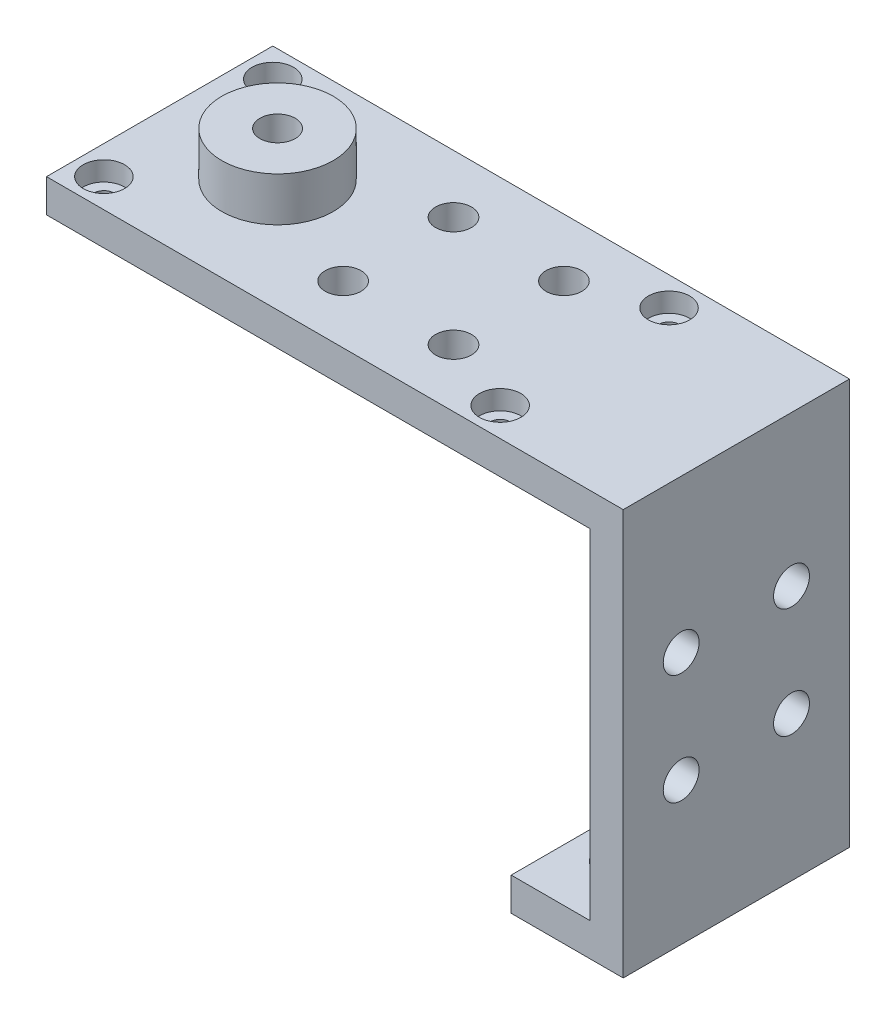
ISO-10303-21;
HEADER;
FILE_DESCRIPTION(('STEP AP214'),'2;1');
FILE_NAME('part.step','',(''),(''),'','','');
FILE_SCHEMA(('AUTOMOTIVE_DESIGN { 1 0 10303 214 1 1 1 1 }'));
ENDSEC;
DATA;
#1=APPLICATION_CONTEXT('core data for automotive mechanical design processes');
#2=APPLICATION_PROTOCOL_DEFINITION('international standard','automotive_design',2000,#1);
#3=PRODUCT_CONTEXT('',#1,'mechanical');
#4=PRODUCT('Part','Part','',(#3));
#5=PRODUCT_RELATED_PRODUCT_CATEGORY('part','',(#4));
#6=PRODUCT_DEFINITION_FORMATION('','',#4);
#7=PRODUCT_DEFINITION_CONTEXT('part definition',#1,'design');
#8=PRODUCT_DEFINITION('design','',#6,#7);
#9=PRODUCT_DEFINITION_SHAPE('','',#8);
#10=(LENGTH_UNIT() NAMED_UNIT(*) SI_UNIT(.MILLI.,.METRE.));
#11=(NAMED_UNIT(*) PLANE_ANGLE_UNIT() SI_UNIT($,.RADIAN.));
#12=(NAMED_UNIT(*) SI_UNIT($,.STERADIAN.) SOLID_ANGLE_UNIT());
#13=UNCERTAINTY_MEASURE_WITH_UNIT(LENGTH_MEASURE(1.E-05),#10,'distance_accuracy_value','');
#14=(GEOMETRIC_REPRESENTATION_CONTEXT(3) GLOBAL_UNCERTAINTY_ASSIGNED_CONTEXT((#13)) GLOBAL_UNIT_ASSIGNED_CONTEXT((#10,
#11,#12)) REPRESENTATION_CONTEXT('',''));
#15=CARTESIAN_POINT('',(0.,0.,0.));
#16=DIRECTION('',(0.,0.,1.));
#17=DIRECTION('',(1.,0.,0.));
#18=AXIS2_PLACEMENT_3D('',#15,#16,#17);
#19=CARTESIAN_POINT('',(15.975,-33.75,-10.25));
#20=DIRECTION('',(0.,-1.,0.));
#21=DIRECTION('',(0.,0.,-1.));
#22=AXIS2_PLACEMENT_3D('',#19,#20,#21);
#23=PLANE('',#22);
#24=CARTESIAN_POINT('',(19.575,-33.75,-4.475));
#25=DIRECTION('',(0.,-1.,0.));
#26=DIRECTION('',(0.,0.,-1.));
#27=AXIS2_PLACEMENT_3D('',#24,#25,#26);
#28=CIRCLE('',#27,1.625);
#29=CARTESIAN_POINT('',(19.575,-33.75,-6.1));
#30=VERTEX_POINT('',#29);
#31=EDGE_CURVE('E259',#30,#30,#28,.F.);
#32=ORIENTED_EDGE('',*,*,#31,.F.);
#33=EDGE_LOOP('',(#32));
#34=FACE_BOUND('',#33,.T.);
#35=DIRECTION('',(0.,0.,-1.));
#36=VECTOR('',#35,1.);
#37=CARTESIAN_POINT('',(15.975,-33.75,-10.25));
#38=LINE('',#37,#36);
#39=CARTESIAN_POINT('',(15.975,-33.75,-0.664672500903811));
#40=VERTEX_POINT('',#39);
#41=CARTESIAN_POINT('',(15.975,-33.75,-10.25));
#42=VERTEX_POINT('',#41);
#43=EDGE_CURVE('E148',#40,#42,#38,.T.);
#44=ORIENTED_EDGE('',*,*,#43,.F.);
#45=DIRECTION('',(-1.,0.,0.));
#46=VECTOR('',#45,1.);
#47=CARTESIAN_POINT('',(25.3453603311175,-33.75,-0.664672500903811));
#48=LINE('',#47,#46);
#49=CARTESIAN_POINT('',(23.125,-33.75,-0.664672500903811));
#50=VERTEX_POINT('',#49);
#51=EDGE_CURVE('E136',#50,#40,#48,.T.);
#52=ORIENTED_EDGE('',*,*,#51,.F.);
#53=DIRECTION('',(0.,0.,-1.));
#54=VECTOR('',#53,1.);
#55=CARTESIAN_POINT('',(23.125,-33.75,-10.25));
#56=LINE('',#55,#54);
#57=CARTESIAN_POINT('',(23.125,-33.75,-10.25));
#58=VERTEX_POINT('',#57);
#59=EDGE_CURVE('E146',#50,#58,#56,.T.);
#60=ORIENTED_EDGE('',*,*,#59,.T.);
#61=DIRECTION('',(1.,0.,0.));
#62=VECTOR('',#61,1.);
#63=CARTESIAN_POINT('',(15.975,-33.75,-10.25));
#64=LINE('',#63,#62);
#65=EDGE_CURVE('E169',#42,#58,#64,.T.);
#66=ORIENTED_EDGE('',*,*,#65,.F.);
#67=EDGE_LOOP('',(#44,#52,#60,#66));
#68=FACE_BOUND('',#67,.T.);
#69=ADVANCED_FACE('F39',(#34,#68),#23,.F.);
#70=CARTESIAN_POINT('',(23.125,-36.75,10.25));
#71=DIRECTION('',(1.,0.,0.));
#72=DIRECTION('',(0.,0.,-1.));
#73=AXIS2_PLACEMENT_3D('',#70,#71,#72);
#74=PLANE('',#73);
#75=CARTESIAN_POINT('',(23.125,-13.8360700129091,5.));
#76=DIRECTION('',(-1.,0.,0.));
#77=DIRECTION('',(0.,0.,1.));
#78=AXIS2_PLACEMENT_3D('',#75,#76,#77);
#79=CIRCLE('',#78,1.625);
#80=CARTESIAN_POINT('',(23.125,-13.8360700129091,6.625));
#81=VERTEX_POINT('',#80);
#82=EDGE_CURVE('E552',#81,#81,#79,.T.);
#83=ORIENTED_EDGE('',*,*,#82,.F.);
#84=EDGE_LOOP('',(#83));
#85=FACE_BOUND('',#84,.T.);
#86=CARTESIAN_POINT('',(23.125,-23.8360700129091,5.));
#87=DIRECTION('',(-1.,0.,0.));
#88=DIRECTION('',(0.,0.,1.));
#89=AXIS2_PLACEMENT_3D('',#86,#87,#88);
#90=CIRCLE('',#89,1.625);
#91=CARTESIAN_POINT('',(23.125,-23.8360700129091,6.625));
#92=VERTEX_POINT('',#91);
#93=EDGE_CURVE('E563',#92,#92,#90,.T.);
#94=ORIENTED_EDGE('',*,*,#93,.F.);
#95=EDGE_LOOP('',(#94));
#96=FACE_BOUND('',#95,.T.);
#97=CARTESIAN_POINT('',(23.125,-23.625,-4.99777222433331));
#98=DIRECTION('',(-1.,0.,0.));
#99=DIRECTION('',(0.,0.,1.));
#100=AXIS2_PLACEMENT_3D('',#97,#98,#99);
#101=CIRCLE('',#100,1.625);
#102=CARTESIAN_POINT('',(23.125,-23.625,-3.37277222433331));
#103=VERTEX_POINT('',#102);
#104=EDGE_CURVE('E553',#103,#103,#101,.T.);
#105=ORIENTED_EDGE('',*,*,#104,.F.);
#106=EDGE_LOOP('',(#105));
#107=FACE_BOUND('',#106,.T.);
#108=CARTESIAN_POINT('',(23.125,-13.625,-4.99777222433331));
#109=DIRECTION('',(-1.,0.,0.));
#110=DIRECTION('',(0.,0.,1.));
#111=AXIS2_PLACEMENT_3D('',#108,#109,#110);
#112=CIRCLE('',#111,1.625);
#113=CARTESIAN_POINT('',(23.125,-13.625,-3.37277222433331));
#114=VERTEX_POINT('',#113);
#115=EDGE_CURVE('E562',#114,#114,#112,.T.);
#116=ORIENTED_EDGE('',*,*,#115,.F.);
#117=EDGE_LOOP('',(#116));
#118=FACE_BOUND('',#117,.T.);
#119=CARTESIAN_POINT('',(23.125,-33.75,10.25));
#120=VERTEX_POINT('',#119);
#121=CARTESIAN_POINT('',(23.125,-33.75,1.13532749909619));
#122=VERTEX_POINT('',#121);
#123=EDGE_CURVE('E155',#120,#122,#56,.T.);
#124=ORIENTED_EDGE('',*,*,#123,.F.);
#125=DIRECTION('',(0.,1.,0.));
#126=VECTOR('',#125,1.);
#127=CARTESIAN_POINT('',(23.125,-36.75,10.25));
#128=LINE('',#127,#126);
#129=CARTESIAN_POINT('',(23.125,-3.,10.25));
#130=VERTEX_POINT('',#129);
#131=EDGE_CURVE('E63',#120,#130,#128,.T.);
#132=ORIENTED_EDGE('',*,*,#131,.T.);
#133=DIRECTION('',(0.,0.,-1.));
#134=VECTOR('',#133,1.);
#135=CARTESIAN_POINT('',(23.125,-3.,10.25));
#136=LINE('',#135,#134);
#137=CARTESIAN_POINT('',(23.125,-3.,-10.25));
#138=VERTEX_POINT('',#137);
#139=EDGE_CURVE('E175',#130,#138,#136,.T.);
#140=ORIENTED_EDGE('',*,*,#139,.T.);
#141=DIRECTION('',(0.,1.,0.));
#142=VECTOR('',#141,1.);
#143=CARTESIAN_POINT('',(23.125,-36.75,-10.25));
#144=LINE('',#143,#142);
#145=EDGE_CURVE('E153',#58,#138,#144,.T.);
#146=ORIENTED_EDGE('',*,*,#145,.F.);
#147=ORIENTED_EDGE('',*,*,#59,.F.);
#148=DIRECTION('',(0.,-1.,0.));
#149=VECTOR('',#148,1.);
#150=CARTESIAN_POINT('',(23.125,-35.05,-0.664672500903811));
#151=LINE('',#150,#149);
#152=CARTESIAN_POINT('',(23.125,-35.05,-0.664672500903811));
#153=VERTEX_POINT('',#152);
#154=EDGE_CURVE('E132',#50,#153,#151,.T.);
#155=ORIENTED_EDGE('',*,*,#154,.T.);
#156=DIRECTION('',(0.,0.,1.));
#157=VECTOR('',#156,1.);
#158=CARTESIAN_POINT('',(23.125,-35.05,-0.664672500903811));
#159=LINE('',#158,#157);
#160=CARTESIAN_POINT('',(23.125,-35.05,1.13532749909619));
#161=VERTEX_POINT('',#160);
#162=EDGE_CURVE('E591',#153,#161,#159,.T.);
#163=ORIENTED_EDGE('',*,*,#162,.T.);
#164=DIRECTION('',(0.,1.,0.));
#165=VECTOR('',#164,1.);
#166=CARTESIAN_POINT('',(23.125,-35.05,1.13532749909619));
#167=LINE('',#166,#165);
#168=EDGE_CURVE('E277',#161,#122,#167,.T.);
#169=ORIENTED_EDGE('',*,*,#168,.T.);
#170=EDGE_LOOP('',(#124,#132,#140,#146,#147,#155,#163,#169));
#171=FACE_BOUND('',#170,.T.);
#172=ADVANCED_FACE('F152',(#85,#96,#107,#118,#171),#74,.F.);
#173=CARTESIAN_POINT('',(26.125,-3.,10.25));
#174=DIRECTION('',(1.,0.,0.));
#175=DIRECTION('',(0.,0.,-1.));
#176=AXIS2_PLACEMENT_3D('',#173,#174,#175);
#177=PLANE('',#176);
#178=CARTESIAN_POINT('',(26.125,-13.8360700129091,5.));
#179=DIRECTION('',(1.,0.,0.));
#180=DIRECTION('',(0.,0.,-1.));
#181=AXIS2_PLACEMENT_3D('',#178,#179,#180);
#182=CIRCLE('',#181,1.625);
#183=CARTESIAN_POINT('',(26.125,-13.8360700129091,3.375));
#184=VERTEX_POINT('',#183);
#185=EDGE_CURVE('E567',#184,#184,#182,.F.);
#186=ORIENTED_EDGE('',*,*,#185,.T.);
#187=EDGE_LOOP('',(#186));
#188=FACE_BOUND('',#187,.T.);
#189=CARTESIAN_POINT('',(26.125,-23.8360700129091,5.));
#190=DIRECTION('',(1.,0.,0.));
#191=DIRECTION('',(0.,0.,-1.));
#192=AXIS2_PLACEMENT_3D('',#189,#190,#191);
#193=CIRCLE('',#192,1.625);
#194=CARTESIAN_POINT('',(26.125,-23.8360700129091,3.375));
#195=VERTEX_POINT('',#194);
#196=EDGE_CURVE('E558',#195,#195,#193,.F.);
#197=ORIENTED_EDGE('',*,*,#196,.T.);
#198=EDGE_LOOP('',(#197));
#199=FACE_BOUND('',#198,.T.);
#200=CARTESIAN_POINT('',(26.125,-23.625,-4.99777222433331));
#201=DIRECTION('',(1.,0.,0.));
#202=DIRECTION('',(0.,0.,-1.));
#203=AXIS2_PLACEMENT_3D('',#200,#201,#202);
#204=CIRCLE('',#203,1.625);
#205=CARTESIAN_POINT('',(26.125,-23.625,-6.62277222433331));
#206=VERTEX_POINT('',#205);
#207=EDGE_CURVE('E557',#206,#206,#204,.F.);
#208=ORIENTED_EDGE('',*,*,#207,.T.);
#209=EDGE_LOOP('',(#208));
#210=FACE_BOUND('',#209,.T.);
#211=CARTESIAN_POINT('',(26.125,-13.625,-4.99777222433331));
#212=DIRECTION('',(1.,0.,0.));
#213=DIRECTION('',(0.,0.,-1.));
#214=AXIS2_PLACEMENT_3D('',#211,#212,#213);
#215=CIRCLE('',#214,1.625);
#216=CARTESIAN_POINT('',(26.125,-13.625,-6.62277222433331));
#217=VERTEX_POINT('',#216);
#218=EDGE_CURVE('E580',#217,#217,#215,.F.);
#219=ORIENTED_EDGE('',*,*,#218,.T.);
#220=EDGE_LOOP('',(#219));
#221=FACE_BOUND('',#220,.T.);
#222=DIRECTION('',(0.,0.,-1.));
#223=VECTOR('',#222,1.);
#224=CARTESIAN_POINT('',(26.125,0.,10.25));
#225=LINE('',#224,#223);
#226=CARTESIAN_POINT('',(26.125,0.,10.25));
#227=VERTEX_POINT('',#226);
#228=CARTESIAN_POINT('',(26.125,0.,-10.25));
#229=VERTEX_POINT('',#228);
#230=EDGE_CURVE('E193',#227,#229,#225,.T.);
#231=ORIENTED_EDGE('',*,*,#230,.F.);
#232=DIRECTION('',(0.,1.,0.));
#233=VECTOR('',#232,1.);
#234=CARTESIAN_POINT('',(26.125,-3.,10.25));
#235=LINE('',#234,#233);
#236=CARTESIAN_POINT('',(26.125,-36.75,10.25));
#237=VERTEX_POINT('',#236);
#238=EDGE_CURVE('E48',#237,#227,#235,.T.);
#239=ORIENTED_EDGE('',*,*,#238,.F.);
#240=DIRECTION('',(0.,0.,1.));
#241=VECTOR('',#240,1.);
#242=CARTESIAN_POINT('',(26.125,-36.75,10.25));
#243=LINE('',#242,#241);
#244=CARTESIAN_POINT('',(26.125,-36.75,-10.25));
#245=VERTEX_POINT('',#244);
#246=EDGE_CURVE('E176',#245,#237,#243,.T.);
#247=ORIENTED_EDGE('',*,*,#246,.F.);
#248=DIRECTION('',(0.,1.,0.));
#249=VECTOR('',#248,1.);
#250=CARTESIAN_POINT('',(26.125,-3.,-10.25));
#251=LINE('',#250,#249);
#252=EDGE_CURVE('E206',#245,#229,#251,.T.);
#253=ORIENTED_EDGE('',*,*,#252,.T.);
#254=EDGE_LOOP('',(#231,#239,#247,#253));
#255=FACE_BOUND('',#254,.T.);
#256=ADVANCED_FACE('F41',(#188,#199,#210,#221,#255),#177,.T.);
#257=CARTESIAN_POINT('',(-26.125,-3.,10.25));
#258=DIRECTION('',(0.,0.,1.));
#259=DIRECTION('',(1.,0.,0.));
#260=AXIS2_PLACEMENT_3D('',#257,#258,#259);
#261=PLANE('',#260);
#262=DIRECTION('',(1.,0.,0.));
#263=VECTOR('',#262,1.);
#264=CARTESIAN_POINT('',(-26.125,0.,10.25));
#265=LINE('',#264,#263);
#266=CARTESIAN_POINT('',(-26.125,0.,10.25));
#267=VERTEX_POINT('',#266);
#268=EDGE_CURVE('E198',#267,#227,#265,.T.);
#269=ORIENTED_EDGE('',*,*,#268,.F.);
#270=DIRECTION('',(0.,1.,0.));
#271=VECTOR('',#270,1.);
#272=CARTESIAN_POINT('',(-26.125,-3.,10.25));
#273=LINE('',#272,#271);
#274=CARTESIAN_POINT('',(-26.125,-3.,10.25));
#275=VERTEX_POINT('',#274);
#276=EDGE_CURVE('E223',#275,#267,#273,.T.);
#277=ORIENTED_EDGE('',*,*,#276,.F.);
#278=DIRECTION('',(1.,0.,0.));
#279=VECTOR('',#278,1.);
#280=CARTESIAN_POINT('',(-26.125,-3.,10.25));
#281=LINE('',#280,#279);
#282=EDGE_CURVE('E202',#275,#130,#281,.T.);
#283=ORIENTED_EDGE('',*,*,#282,.T.);
#284=ORIENTED_EDGE('',*,*,#131,.F.);
#285=DIRECTION('',(1.,0.,0.));
#286=VECTOR('',#285,1.);
#287=CARTESIAN_POINT('',(15.975,-33.75,10.25));
#288=LINE('',#287,#286);
#289=CARTESIAN_POINT('',(15.975,-33.75,10.25));
#290=VERTEX_POINT('',#289);
#291=EDGE_CURVE('E172',#290,#120,#288,.T.);
#292=ORIENTED_EDGE('',*,*,#291,.F.);
#293=DIRECTION('',(0.,1.,0.));
#294=VECTOR('',#293,1.);
#295=CARTESIAN_POINT('',(15.975,-36.75,10.25));
#296=LINE('',#295,#294);
#297=CARTESIAN_POINT('',(15.975,-36.75,10.25));
#298=VERTEX_POINT('',#297);
#299=EDGE_CURVE('E245',#298,#290,#296,.T.);
#300=ORIENTED_EDGE('',*,*,#299,.F.);
#301=DIRECTION('',(-1.,0.,0.));
#302=VECTOR('',#301,1.);
#303=CARTESIAN_POINT('',(26.125,-36.75,10.25));
#304=LINE('',#303,#302);
#305=EDGE_CURVE('E180',#237,#298,#304,.T.);
#306=ORIENTED_EDGE('',*,*,#305,.F.);
#307=ORIENTED_EDGE('',*,*,#238,.T.);
#308=EDGE_LOOP('',(#269,#277,#283,#284,#292,#300,#306,#307));
#309=FACE_BOUND('',#308,.T.);
#310=ADVANCED_FACE('F241',(#309),#261,.T.);
#311=CARTESIAN_POINT('',(-26.125,-3.,10.25));
#312=DIRECTION('',(-1.,0.,0.));
#313=DIRECTION('',(0.,0.,1.));
#314=AXIS2_PLACEMENT_3D('',#311,#312,#313);
#315=PLANE('',#314);
#316=DIRECTION('',(0.,0.,1.));
#317=VECTOR('',#316,1.);
#318=CARTESIAN_POINT('',(-26.125,0.,10.25));
#319=LINE('',#318,#317);
#320=CARTESIAN_POINT('',(-26.125,0.,-10.25));
#321=VERTEX_POINT('',#320);
#322=EDGE_CURVE('E214',#321,#267,#319,.T.);
#323=ORIENTED_EDGE('',*,*,#322,.F.);
#324=DIRECTION('',(0.,1.,0.));
#325=VECTOR('',#324,1.);
#326=CARTESIAN_POINT('',(-26.125,-3.,-10.25));
#327=LINE('',#326,#325);
#328=CARTESIAN_POINT('',(-26.125,-3.,-10.25));
#329=VERTEX_POINT('',#328);
#330=EDGE_CURVE('E226',#329,#321,#327,.T.);
#331=ORIENTED_EDGE('',*,*,#330,.F.);
#332=DIRECTION('',(0.,0.,1.));
#333=VECTOR('',#332,1.);
#334=CARTESIAN_POINT('',(-26.125,-3.,10.25));
#335=LINE('',#334,#333);
#336=EDGE_CURVE('E197',#329,#275,#335,.T.);
#337=ORIENTED_EDGE('',*,*,#336,.T.);
#338=ORIENTED_EDGE('',*,*,#276,.T.);
#339=EDGE_LOOP('',(#323,#331,#337,#338));
#340=FACE_BOUND('',#339,.T.);
#341=ADVANCED_FACE('F602',(#340),#315,.T.);
#342=CARTESIAN_POINT('',(-26.125,-3.,-10.25));
#343=DIRECTION('',(0.,0.,-1.));
#344=DIRECTION('',(-1.,0.,0.));
#345=AXIS2_PLACEMENT_3D('',#342,#343,#344);
#346=PLANE('',#345);
#347=DIRECTION('',(-1.,0.,0.));
#348=VECTOR('',#347,1.);
#349=CARTESIAN_POINT('',(-26.125,0.,-10.25));
#350=LINE('',#349,#348);
#351=EDGE_CURVE('E210',#229,#321,#350,.T.);
#352=ORIENTED_EDGE('',*,*,#351,.F.);
#353=ORIENTED_EDGE('',*,*,#252,.F.);
#354=DIRECTION('',(1.,0.,0.));
#355=VECTOR('',#354,1.);
#356=CARTESIAN_POINT('',(26.125,-36.75,-10.25));
#357=LINE('',#356,#355);
#358=CARTESIAN_POINT('',(15.975,-36.75,-10.25));
#359=VERTEX_POINT('',#358);
#360=EDGE_CURVE('E183',#359,#245,#357,.T.);
#361=ORIENTED_EDGE('',*,*,#360,.F.);
#362=DIRECTION('',(0.,-1.,0.));
#363=VECTOR('',#362,1.);
#364=CARTESIAN_POINT('',(15.975,-36.75,-10.25));
#365=LINE('',#364,#363);
#366=EDGE_CURVE('E161',#42,#359,#365,.T.);
#367=ORIENTED_EDGE('',*,*,#366,.F.);
#368=ORIENTED_EDGE('',*,*,#65,.T.);
#369=ORIENTED_EDGE('',*,*,#145,.T.);
#370=DIRECTION('',(-1.,0.,0.));
#371=VECTOR('',#370,1.);
#372=CARTESIAN_POINT('',(-26.125,-3.,-10.25));
#373=LINE('',#372,#371);
#374=EDGE_CURVE('E194',#138,#329,#373,.T.);
#375=ORIENTED_EDGE('',*,*,#374,.T.);
#376=ORIENTED_EDGE('',*,*,#330,.T.);
#377=EDGE_LOOP('',(#352,#353,#361,#367,#368,#369,#375,#376));
#378=FACE_BOUND('',#377,.T.);
#379=ADVANCED_FACE('F234',(#378),#346,.T.);
#380=CARTESIAN_POINT('',(0.,-3.,0.));
#381=DIRECTION('',(0.,-1.,0.));
#382=DIRECTION('',(0.,0.,-1.));
#383=AXIS2_PLACEMENT_3D('',#380,#381,#382);
#384=PLANE('',#383);
#385=CARTESIAN_POINT('',(-15.4428498964803,-3.,0.));
#386=DIRECTION('',(0.,-1.,0.));
#387=DIRECTION('',(0.,0.,-1.));
#388=AXIS2_PLACEMENT_3D('',#385,#386,#387);
#389=CIRCLE('',#388,4.);
#390=CARTESIAN_POINT('',(-15.4428498964803,-3.,-4.));
#391=VERTEX_POINT('',#390);
#392=EDGE_CURVE('E440',#391,#391,#389,.T.);
#393=ORIENTED_EDGE('',*,*,#392,.F.);
#394=EDGE_LOOP('',(#393));
#395=FACE_BOUND('',#394,.T.);
#396=CARTESIAN_POINT('',(12.375,-3.,-7.65));
#397=DIRECTION('',(0.,-1.,0.));
#398=DIRECTION('',(0.,0.,-1.));
#399=AXIS2_PLACEMENT_3D('',#396,#397,#398);
#400=CIRCLE('',#399,0.925000000000001);
#401=CARTESIAN_POINT('',(12.375,-3.,-8.575));
#402=VERTEX_POINT('',#401);
#403=EDGE_CURVE('E471',#402,#402,#400,.F.);
#404=ORIENTED_EDGE('',*,*,#403,.T.);
#405=EDGE_LOOP('',(#404));
#406=FACE_BOUND('',#405,.T.);
#407=CARTESIAN_POINT('',(12.375,-3.,7.65));
#408=DIRECTION('',(0.,-1.,0.));
#409=DIRECTION('',(0.,0.,-1.));
#410=AXIS2_PLACEMENT_3D('',#407,#408,#409);
#411=CIRCLE('',#410,0.925000000000001);
#412=CARTESIAN_POINT('',(12.375,-3.,6.725));
#413=VERTEX_POINT('',#412);
#414=EDGE_CURVE('E462',#413,#413,#411,.F.);
#415=ORIENTED_EDGE('',*,*,#414,.T.);
#416=EDGE_LOOP('',(#415));
#417=FACE_BOUND('',#416,.T.);
#418=CARTESIAN_POINT('',(-23.525,-3.,7.65));
#419=DIRECTION('',(0.,-1.,0.));
#420=DIRECTION('',(0.,0.,-1.));
#421=AXIS2_PLACEMENT_3D('',#418,#419,#420);
#422=CIRCLE('',#421,0.924999999999999);
#423=CARTESIAN_POINT('',(-23.525,-3.,6.725));
#424=VERTEX_POINT('',#423);
#425=EDGE_CURVE('E461',#424,#424,#422,.F.);
#426=ORIENTED_EDGE('',*,*,#425,.T.);
#427=EDGE_LOOP('',(#426));
#428=FACE_BOUND('',#427,.T.);
#429=CARTESIAN_POINT('',(-23.525,-3.,-7.65));
#430=DIRECTION('',(0.,-1.,0.));
#431=DIRECTION('',(0.,0.,-1.));
#432=AXIS2_PLACEMENT_3D('',#429,#430,#431);
#433=CIRCLE('',#432,0.924999999999999);
#434=CARTESIAN_POINT('',(-23.525,-3.,-8.575));
#435=VERTEX_POINT('',#434);
#436=EDGE_CURVE('E484',#435,#435,#433,.F.);
#437=ORIENTED_EDGE('',*,*,#436,.T.);
#438=EDGE_LOOP('',(#437));
#439=FACE_BOUND('',#438,.T.);
#440=CARTESIAN_POINT('',(-4.5,-3.,5.));
#441=DIRECTION('',(0.,-1.,0.));
#442=DIRECTION('',(0.,0.,-1.));
#443=AXIS2_PLACEMENT_3D('',#440,#441,#442);
#444=CIRCLE('',#443,1.625);
#445=CARTESIAN_POINT('',(-4.5,-3.,3.375));
#446=VERTEX_POINT('',#445);
#447=EDGE_CURVE('E533',#446,#446,#444,.F.);
#448=ORIENTED_EDGE('',*,*,#447,.T.);
#449=EDGE_LOOP('',(#448));
#450=FACE_BOUND('',#449,.T.);
#451=CARTESIAN_POINT('',(5.5,-3.,-5.));
#452=DIRECTION('',(0.,-1.,0.));
#453=DIRECTION('',(0.,0.,-1.));
#454=AXIS2_PLACEMENT_3D('',#451,#452,#453);
#455=CIRCLE('',#454,1.625);
#456=CARTESIAN_POINT('',(5.5,-3.,-6.625));
#457=VERTEX_POINT('',#456);
#458=EDGE_CURVE('E534',#457,#457,#455,.F.);
#459=ORIENTED_EDGE('',*,*,#458,.T.);
#460=EDGE_LOOP('',(#459));
#461=FACE_BOUND('',#460,.T.);
#462=CARTESIAN_POINT('',(5.5,-3.,5.));
#463=DIRECTION('',(0.,-1.,0.));
#464=DIRECTION('',(0.,0.,-1.));
#465=AXIS2_PLACEMENT_3D('',#462,#463,#464);
#466=CIRCLE('',#465,1.625);
#467=CARTESIAN_POINT('',(5.5,-3.,3.375));
#468=VERTEX_POINT('',#467);
#469=EDGE_CURVE('E524',#468,#468,#466,.F.);
#470=ORIENTED_EDGE('',*,*,#469,.T.);
#471=EDGE_LOOP('',(#470));
#472=FACE_BOUND('',#471,.T.);
#473=CARTESIAN_POINT('',(-4.5,-3.,-5.));
#474=DIRECTION('',(0.,-1.,0.));
#475=DIRECTION('',(0.,0.,-1.));
#476=AXIS2_PLACEMENT_3D('',#473,#474,#475);
#477=CIRCLE('',#476,1.625);
#478=CARTESIAN_POINT('',(-4.5,-3.,-6.625));
#479=VERTEX_POINT('',#478);
#480=EDGE_CURVE('E548',#479,#479,#477,.F.);
#481=ORIENTED_EDGE('',*,*,#480,.T.);
#482=EDGE_LOOP('',(#481));
#483=FACE_BOUND('',#482,.T.);
#484=ORIENTED_EDGE('',*,*,#139,.F.);
#485=ORIENTED_EDGE('',*,*,#282,.F.);
#486=ORIENTED_EDGE('',*,*,#336,.F.);
#487=ORIENTED_EDGE('',*,*,#374,.F.);
#488=EDGE_LOOP('',(#484,#485,#486,#487));
#489=FACE_BOUND('',#488,.T.);
#490=ADVANCED_FACE('F599',(#395,#406,#417,#428,#439,#450,#461,#472,#483,#489),#384,.T.);
#491=CARTESIAN_POINT('',(0.,0.,0.));
#492=DIRECTION('',(0.,-1.,0.));
#493=DIRECTION('',(0.,0.,-1.));
#494=AXIS2_PLACEMENT_3D('',#491,#492,#493);
#495=PLANE('',#494);
#496=CARTESIAN_POINT('',(-15.4428498964803,0.,0.));
#497=DIRECTION('',(0.,-1.,0.));
#498=DIRECTION('',(0.,0.,-1.));
#499=AXIS2_PLACEMENT_3D('',#496,#497,#498);
#500=CIRCLE('',#499,5.05);
#501=CARTESIAN_POINT('',(-15.4428498964803,0.,-5.05));
#502=VERTEX_POINT('',#501);
#503=EDGE_CURVE('E11',#502,#502,#500,.F.);
#504=ORIENTED_EDGE('',*,*,#503,.F.);
#505=EDGE_LOOP('',(#504));
#506=FACE_BOUND('',#505,.T.);
#507=CARTESIAN_POINT('',(-23.525,0.,7.65));
#508=DIRECTION('',(0.,1.,0.));
#509=DIRECTION('',(0.,0.,1.));
#510=AXIS2_PLACEMENT_3D('',#507,#508,#509);
#511=CIRCLE('',#510,1.875);
#512=CARTESIAN_POINT('',(-23.525,0.,9.525));
#513=VERTEX_POINT('',#512);
#514=EDGE_CURVE('E502',#513,#513,#511,.T.);
#515=ORIENTED_EDGE('',*,*,#514,.F.);
#516=EDGE_LOOP('',(#515));
#517=FACE_BOUND('',#516,.T.);
#518=CARTESIAN_POINT('',(12.375,0.,-7.65));
#519=DIRECTION('',(0.,1.,0.));
#520=DIRECTION('',(0.,0.,1.));
#521=AXIS2_PLACEMENT_3D('',#518,#519,#520);
#522=CIRCLE('',#521,1.875);
#523=CARTESIAN_POINT('',(12.375,0.,-5.775));
#524=VERTEX_POINT('',#523);
#525=EDGE_CURVE('E493',#524,#524,#522,.T.);
#526=ORIENTED_EDGE('',*,*,#525,.F.);
#527=EDGE_LOOP('',(#526));
#528=FACE_BOUND('',#527,.T.);
#529=CARTESIAN_POINT('',(12.375,0.,7.65));
#530=DIRECTION('',(0.,1.,0.));
#531=DIRECTION('',(0.,0.,1.));
#532=AXIS2_PLACEMENT_3D('',#529,#530,#531);
#533=CIRCLE('',#532,1.875);
#534=CARTESIAN_POINT('',(12.375,0.,9.525));
#535=VERTEX_POINT('',#534);
#536=EDGE_CURVE('E488',#535,#535,#533,.T.);
#537=ORIENTED_EDGE('',*,*,#536,.F.);
#538=EDGE_LOOP('',(#537));
#539=FACE_BOUND('',#538,.T.);
#540=CARTESIAN_POINT('',(-23.525,0.,-7.65));
#541=DIRECTION('',(0.,1.,0.));
#542=DIRECTION('',(0.,0.,1.));
#543=AXIS2_PLACEMENT_3D('',#540,#541,#542);
#544=CIRCLE('',#543,1.875);
#545=CARTESIAN_POINT('',(-23.525,0.,-5.775));
#546=VERTEX_POINT('',#545);
#547=EDGE_CURVE('E501',#546,#546,#544,.T.);
#548=ORIENTED_EDGE('',*,*,#547,.F.);
#549=EDGE_LOOP('',(#548));
#550=FACE_BOUND('',#549,.T.);
#551=CARTESIAN_POINT('',(-4.5,0.,5.));
#552=DIRECTION('',(0.,1.,0.));
#553=DIRECTION('',(0.,0.,1.));
#554=AXIS2_PLACEMENT_3D('',#551,#552,#553);
#555=CIRCLE('',#554,1.625);
#556=CARTESIAN_POINT('',(-4.5,0.,6.625));
#557=VERTEX_POINT('',#556);
#558=EDGE_CURVE('E529',#557,#557,#555,.T.);
#559=ORIENTED_EDGE('',*,*,#558,.F.);
#560=EDGE_LOOP('',(#559));
#561=FACE_BOUND('',#560,.T.);
#562=CARTESIAN_POINT('',(5.5,0.,-5.));
#563=DIRECTION('',(0.,1.,0.));
#564=DIRECTION('',(0.,0.,1.));
#565=AXIS2_PLACEMENT_3D('',#562,#563,#564);
#566=CIRCLE('',#565,1.625);
#567=CARTESIAN_POINT('',(5.5,0.,-3.375));
#568=VERTEX_POINT('',#567);
#569=EDGE_CURVE('E528',#568,#568,#566,.T.);
#570=ORIENTED_EDGE('',*,*,#569,.F.);
#571=EDGE_LOOP('',(#570));
#572=FACE_BOUND('',#571,.T.);
#573=CARTESIAN_POINT('',(5.5,0.,5.));
#574=DIRECTION('',(0.,1.,0.));
#575=DIRECTION('',(0.,0.,1.));
#576=AXIS2_PLACEMENT_3D('',#573,#574,#575);
#577=CIRCLE('',#576,1.625);
#578=CARTESIAN_POINT('',(5.5,0.,6.625));
#579=VERTEX_POINT('',#578);
#580=EDGE_CURVE('E517',#579,#579,#577,.T.);
#581=ORIENTED_EDGE('',*,*,#580,.F.);
#582=EDGE_LOOP('',(#581));
#583=FACE_BOUND('',#582,.T.);
#584=CARTESIAN_POINT('',(-4.5,0.,-5.));
#585=DIRECTION('',(0.,1.,0.));
#586=DIRECTION('',(0.,0.,1.));
#587=AXIS2_PLACEMENT_3D('',#584,#585,#586);
#588=CIRCLE('',#587,1.625);
#589=CARTESIAN_POINT('',(-4.5,0.,-3.375));
#590=VERTEX_POINT('',#589);
#591=EDGE_CURVE('E538',#590,#590,#588,.T.);
#592=ORIENTED_EDGE('',*,*,#591,.F.);
#593=EDGE_LOOP('',(#592));
#594=FACE_BOUND('',#593,.T.);
#595=ORIENTED_EDGE('',*,*,#230,.T.);
#596=ORIENTED_EDGE('',*,*,#351,.T.);
#597=ORIENTED_EDGE('',*,*,#322,.T.);
#598=ORIENTED_EDGE('',*,*,#268,.T.);
#599=EDGE_LOOP('',(#595,#596,#597,#598));
#600=FACE_BOUND('',#599,.T.);
#601=ADVANCED_FACE('F238',(#506,#517,#528,#539,#550,#561,#572,#583,#594,#600),#495,.F.);
#602=CARTESIAN_POINT('',(0.,-36.75,0.));
#603=DIRECTION('',(0.,1.,0.));
#604=DIRECTION('',(0.,0.,1.));
#605=AXIS2_PLACEMENT_3D('',#602,#603,#604);
#606=PLANE('',#605);
#607=CARTESIAN_POINT('',(19.575,-36.75,4.475));
#608=DIRECTION('',(0.,-1.,0.));
#609=DIRECTION('',(0.,0.,-1.));
#610=AXIS2_PLACEMENT_3D('',#607,#608,#609);
#611=CIRCLE('',#610,1.625);
#612=CARTESIAN_POINT('',(19.575,-36.75,2.85));
#613=VERTEX_POINT('',#612);
#614=EDGE_CURVE('E163',#613,#613,#611,.T.);
#615=ORIENTED_EDGE('',*,*,#614,.F.);
#616=EDGE_LOOP('',(#615));
#617=FACE_BOUND('',#616,.T.);
#618=CARTESIAN_POINT('',(19.575,-36.75,-4.475));
#619=DIRECTION('',(0.,-1.,0.));
#620=DIRECTION('',(0.,0.,-1.));
#621=AXIS2_PLACEMENT_3D('',#618,#619,#620);
#622=CIRCLE('',#621,1.625);
#623=CARTESIAN_POINT('',(19.575,-36.75,-6.1));
#624=VERTEX_POINT('',#623);
#625=EDGE_CURVE('E276',#624,#624,#622,.T.);
#626=ORIENTED_EDGE('',*,*,#625,.F.);
#627=EDGE_LOOP('',(#626));
#628=FACE_BOUND('',#627,.T.);
#629=ORIENTED_EDGE('',*,*,#246,.T.);
#630=ORIENTED_EDGE('',*,*,#305,.T.);
#631=DIRECTION('',(0.,0.,1.));
#632=VECTOR('',#631,1.);
#633=CARTESIAN_POINT('',(15.975,-36.75,-10.25));
#634=LINE('',#633,#632);
#635=EDGE_CURVE('E250',#359,#298,#634,.T.);
#636=ORIENTED_EDGE('',*,*,#635,.F.);
#637=ORIENTED_EDGE('',*,*,#360,.T.);
#638=EDGE_LOOP('',(#629,#630,#636,#637));
#639=FACE_BOUND('',#638,.T.);
#640=ADVANCED_FACE('F249',(#617,#628,#639),#606,.F.);
#641=CARTESIAN_POINT('',(19.575,-33.75,4.475));
#642=DIRECTION('',(0.,-1.,0.));
#643=DIRECTION('',(0.,0.,-1.));
#644=AXIS2_PLACEMENT_3D('',#641,#642,#643);
#645=CIRCLE('',#644,1.625);
#646=CARTESIAN_POINT('',(19.575,-33.75,2.85));
#647=VERTEX_POINT('',#646);
#648=EDGE_CURVE('E156',#647,#647,#645,.F.);
#649=ORIENTED_EDGE('',*,*,#648,.F.);
#650=EDGE_LOOP('',(#649));
#651=FACE_BOUND('',#650,.T.);
#652=ORIENTED_EDGE('',*,*,#123,.T.);
#653=DIRECTION('',(-1.,0.,0.));
#654=VECTOR('',#653,1.);
#655=CARTESIAN_POINT('',(25.3453603311175,-33.75,1.13532749909619));
#656=LINE('',#655,#654);
#657=CARTESIAN_POINT('',(15.975,-33.75,1.13532749909619));
#658=VERTEX_POINT('',#657);
#659=EDGE_CURVE('E273',#122,#658,#656,.T.);
#660=ORIENTED_EDGE('',*,*,#659,.T.);
#661=EDGE_CURVE('E167',#290,#658,#38,.T.);
#662=ORIENTED_EDGE('',*,*,#661,.F.);
#663=ORIENTED_EDGE('',*,*,#291,.T.);
#664=EDGE_LOOP('',(#652,#660,#662,#663));
#665=FACE_BOUND('',#664,.T.);
#666=ADVANCED_FACE('F271',(#651,#665),#23,.F.);
#667=CARTESIAN_POINT('',(15.975,0.,0.));
#668=DIRECTION('',(1.,0.,0.));
#669=DIRECTION('',(0.,0.,-1.));
#670=AXIS2_PLACEMENT_3D('',#667,#668,#669);
#671=PLANE('',#670);
#672=DIRECTION('',(0.,0.,1.));
#673=VECTOR('',#672,1.);
#674=CARTESIAN_POINT('',(15.975,-35.05,-0.664672500903811));
#675=LINE('',#674,#673);
#676=CARTESIAN_POINT('',(15.975,-35.05,-0.664672500903811));
#677=VERTEX_POINT('',#676);
#678=CARTESIAN_POINT('',(15.975,-35.05,1.13532749909619));
#679=VERTEX_POINT('',#678);
#680=EDGE_CURVE('E55',#677,#679,#675,.T.);
#681=ORIENTED_EDGE('',*,*,#680,.F.);
#682=DIRECTION('',(0.,-1.,0.));
#683=VECTOR('',#682,1.);
#684=CARTESIAN_POINT('',(15.975,-35.05,-0.664672500903811));
#685=LINE('',#684,#683);
#686=EDGE_CURVE('E586',#40,#677,#685,.T.);
#687=ORIENTED_EDGE('',*,*,#686,.F.);
#688=ORIENTED_EDGE('',*,*,#43,.T.);
#689=ORIENTED_EDGE('',*,*,#366,.T.);
#690=ORIENTED_EDGE('',*,*,#635,.T.);
#691=ORIENTED_EDGE('',*,*,#299,.T.);
#692=ORIENTED_EDGE('',*,*,#661,.T.);
#693=DIRECTION('',(0.,1.,0.));
#694=VECTOR('',#693,1.);
#695=CARTESIAN_POINT('',(15.975,-35.05,1.13532749909619));
#696=LINE('',#695,#694);
#697=EDGE_CURVE('E268',#679,#658,#696,.T.);
#698=ORIENTED_EDGE('',*,*,#697,.F.);
#699=EDGE_LOOP('',(#681,#687,#688,#689,#690,#691,#692,#698));
#700=FACE_BOUND('',#699,.T.);
#701=ADVANCED_FACE('F267',(#700),#671,.F.);
#702=CARTESIAN_POINT('',(19.575,-29.1538059222874,-4.475));
#703=DIRECTION('',(0.,-1.,0.));
#704=DIRECTION('',(0.,0.,-1.));
#705=AXIS2_PLACEMENT_3D('',#702,#703,#704);
#706=CYLINDRICAL_SURFACE('',#705,1.625);
#707=ORIENTED_EDGE('',*,*,#31,.T.);
#708=EDGE_LOOP('',(#707));
#709=FACE_BOUND('',#708,.T.);
#710=ORIENTED_EDGE('',*,*,#625,.T.);
#711=EDGE_LOOP('',(#710));
#712=FACE_BOUND('',#711,.T.);
#713=ADVANCED_FACE('F294',(#709,#712),#706,.F.);
#714=CARTESIAN_POINT('',(19.575,-29.1538059222874,4.475));
#715=DIRECTION('',(0.,-1.,0.));
#716=DIRECTION('',(0.,0.,-1.));
#717=AXIS2_PLACEMENT_3D('',#714,#715,#716);
#718=CYLINDRICAL_SURFACE('',#717,1.625);
#719=ORIENTED_EDGE('',*,*,#648,.T.);
#720=EDGE_LOOP('',(#719));
#721=FACE_BOUND('',#720,.T.);
#722=ORIENTED_EDGE('',*,*,#614,.T.);
#723=EDGE_LOOP('',(#722));
#724=FACE_BOUND('',#723,.T.);
#725=ADVANCED_FACE('F315',(#721,#724),#718,.F.);
#726=CARTESIAN_POINT('',(25.3453603311175,-35.05,-0.664672500903811));
#727=DIRECTION('',(0.,0.,-1.));
#728=DIRECTION('',(-1.,0.,0.));
#729=AXIS2_PLACEMENT_3D('',#726,#727,#728);
#730=PLANE('',#729);
#731=ORIENTED_EDGE('',*,*,#51,.T.);
#732=ORIENTED_EDGE('',*,*,#686,.T.);
#733=DIRECTION('',(-1.,0.,0.));
#734=VECTOR('',#733,1.);
#735=CARTESIAN_POINT('',(25.3453603311175,-35.05,-0.664672500903811));
#736=LINE('',#735,#734);
#737=EDGE_CURVE('E138',#153,#677,#736,.T.);
#738=ORIENTED_EDGE('',*,*,#737,.F.);
#739=ORIENTED_EDGE('',*,*,#154,.F.);
#740=EDGE_LOOP('',(#731,#732,#738,#739));
#741=FACE_BOUND('',#740,.T.);
#742=ADVANCED_FACE('F134',(#741),#730,.F.);
#743=CARTESIAN_POINT('',(25.3453603311175,-35.05,-0.664672500903811));
#744=DIRECTION('',(0.,-1.,0.));
#745=DIRECTION('',(0.,0.,-1.));
#746=AXIS2_PLACEMENT_3D('',#743,#744,#745);
#747=PLANE('',#746);
#748=ORIENTED_EDGE('',*,*,#737,.T.);
#749=ORIENTED_EDGE('',*,*,#680,.T.);
#750=DIRECTION('',(-1.,0.,0.));
#751=VECTOR('',#750,1.);
#752=CARTESIAN_POINT('',(25.3453603311175,-35.05,1.13532749909619));
#753=LINE('',#752,#751);
#754=EDGE_CURVE('E282',#161,#679,#753,.T.);
#755=ORIENTED_EDGE('',*,*,#754,.F.);
#756=ORIENTED_EDGE('',*,*,#162,.F.);
#757=EDGE_LOOP('',(#748,#749,#755,#756));
#758=FACE_BOUND('',#757,.T.);
#759=ADVANCED_FACE('F322',(#758),#747,.F.);
#760=CARTESIAN_POINT('',(25.3453603311175,-35.05,1.13532749909619));
#761=DIRECTION('',(0.,0.,1.));
#762=DIRECTION('',(0.,-1.,0.));
#763=AXIS2_PLACEMENT_3D('',#760,#761,#762);
#764=PLANE('',#763);
#765=ORIENTED_EDGE('',*,*,#754,.T.);
#766=ORIENTED_EDGE('',*,*,#697,.T.);
#767=ORIENTED_EDGE('',*,*,#659,.F.);
#768=ORIENTED_EDGE('',*,*,#168,.F.);
#769=EDGE_LOOP('',(#765,#766,#767,#768));
#770=FACE_BOUND('',#769,.T.);
#771=ADVANCED_FACE('F328',(#770),#764,.F.);
#772=CARTESIAN_POINT('',(30.7211940777126,-13.625,-4.99777222433331));
#773=DIRECTION('',(-1.,0.,0.));
#774=DIRECTION('',(0.,0.,1.));
#775=AXIS2_PLACEMENT_3D('',#772,#773,#774);
#776=CYLINDRICAL_SURFACE('',#775,1.625);
#777=ORIENTED_EDGE('',*,*,#115,.T.);
#778=EDGE_LOOP('',(#777));
#779=FACE_BOUND('',#778,.T.);
#780=ORIENTED_EDGE('',*,*,#218,.F.);
#781=EDGE_LOOP('',(#780));
#782=FACE_BOUND('',#781,.T.);
#783=ADVANCED_FACE('F331',(#779,#782),#776,.F.);
#784=CARTESIAN_POINT('',(30.7211940777126,-23.625,-4.99777222433331));
#785=DIRECTION('',(-1.,0.,0.));
#786=DIRECTION('',(0.,0.,1.));
#787=AXIS2_PLACEMENT_3D('',#784,#785,#786);
#788=CYLINDRICAL_SURFACE('',#787,1.625);
#789=ORIENTED_EDGE('',*,*,#104,.T.);
#790=EDGE_LOOP('',(#789));
#791=FACE_BOUND('',#790,.T.);
#792=ORIENTED_EDGE('',*,*,#207,.F.);
#793=EDGE_LOOP('',(#792));
#794=FACE_BOUND('',#793,.T.);
#795=ADVANCED_FACE('F334',(#791,#794),#788,.F.);
#796=CARTESIAN_POINT('',(30.7211940777126,-23.8360700129091,5.));
#797=DIRECTION('',(-1.,0.,0.));
#798=DIRECTION('',(0.,0.,1.));
#799=AXIS2_PLACEMENT_3D('',#796,#797,#798);
#800=CYLINDRICAL_SURFACE('',#799,1.625);
#801=ORIENTED_EDGE('',*,*,#93,.T.);
#802=EDGE_LOOP('',(#801));
#803=FACE_BOUND('',#802,.T.);
#804=ORIENTED_EDGE('',*,*,#196,.F.);
#805=EDGE_LOOP('',(#804));
#806=FACE_BOUND('',#805,.T.);
#807=ADVANCED_FACE('F340',(#803,#806),#800,.F.);
#808=CARTESIAN_POINT('',(30.7211940777126,-13.8360700129091,5.));
#809=DIRECTION('',(-1.,0.,0.));
#810=DIRECTION('',(0.,0.,1.));
#811=AXIS2_PLACEMENT_3D('',#808,#809,#810);
#812=CYLINDRICAL_SURFACE('',#811,1.625);
#813=ORIENTED_EDGE('',*,*,#82,.T.);
#814=EDGE_LOOP('',(#813));
#815=FACE_BOUND('',#814,.T.);
#816=ORIENTED_EDGE('',*,*,#185,.F.);
#817=EDGE_LOOP('',(#816));
#818=FACE_BOUND('',#817,.T.);
#819=ADVANCED_FACE('F336',(#815,#818),#812,.F.);
#820=CARTESIAN_POINT('',(-4.5,-7.59619407771256,-5.));
#821=DIRECTION('',(0.,1.,0.));
#822=DIRECTION('',(0.,0.,1.));
#823=AXIS2_PLACEMENT_3D('',#820,#821,#822);
#824=CYLINDRICAL_SURFACE('',#823,1.625);
#825=ORIENTED_EDGE('',*,*,#591,.T.);
#826=EDGE_LOOP('',(#825));
#827=FACE_BOUND('',#826,.T.);
#828=ORIENTED_EDGE('',*,*,#480,.F.);
#829=EDGE_LOOP('',(#828));
#830=FACE_BOUND('',#829,.T.);
#831=ADVANCED_FACE('F339',(#827,#830),#824,.F.);
#832=CARTESIAN_POINT('',(5.5,-7.59619407771256,5.));
#833=DIRECTION('',(0.,1.,0.));
#834=DIRECTION('',(0.,0.,1.));
#835=AXIS2_PLACEMENT_3D('',#832,#833,#834);
#836=CYLINDRICAL_SURFACE('',#835,1.625);
#837=ORIENTED_EDGE('',*,*,#580,.T.);
#838=EDGE_LOOP('',(#837));
#839=FACE_BOUND('',#838,.T.);
#840=ORIENTED_EDGE('',*,*,#469,.F.);
#841=EDGE_LOOP('',(#840));
#842=FACE_BOUND('',#841,.T.);
#843=ADVANCED_FACE('F350',(#839,#842),#836,.F.);
#844=CARTESIAN_POINT('',(5.5,-7.59619407771256,-5.));
#845=DIRECTION('',(0.,1.,0.));
#846=DIRECTION('',(0.,0.,1.));
#847=AXIS2_PLACEMENT_3D('',#844,#845,#846);
#848=CYLINDRICAL_SURFACE('',#847,1.625);
#849=ORIENTED_EDGE('',*,*,#569,.T.);
#850=EDGE_LOOP('',(#849));
#851=FACE_BOUND('',#850,.T.);
#852=ORIENTED_EDGE('',*,*,#458,.F.);
#853=EDGE_LOOP('',(#852));
#854=FACE_BOUND('',#853,.T.);
#855=ADVANCED_FACE('F352',(#851,#854),#848,.F.);
#856=CARTESIAN_POINT('',(-4.5,-7.59619407771256,5.));
#857=DIRECTION('',(0.,1.,0.));
#858=DIRECTION('',(0.,0.,1.));
#859=AXIS2_PLACEMENT_3D('',#856,#857,#858);
#860=CYLINDRICAL_SURFACE('',#859,1.625);
#861=ORIENTED_EDGE('',*,*,#558,.T.);
#862=EDGE_LOOP('',(#861));
#863=FACE_BOUND('',#862,.T.);
#864=ORIENTED_EDGE('',*,*,#447,.F.);
#865=EDGE_LOOP('',(#864));
#866=FACE_BOUND('',#865,.T.);
#867=ADVANCED_FACE('F355',(#863,#866),#860,.F.);
#868=CARTESIAN_POINT('',(-23.525,-1.75,-7.65));
#869=DIRECTION('',(0.,1.,0.));
#870=DIRECTION('',(0.,0.,1.));
#871=AXIS2_PLACEMENT_3D('',#868,#869,#870);
#872=CYLINDRICAL_SURFACE('',#871,1.875);
#873=CARTESIAN_POINT('',(-23.525,-1.75,-7.65));
#874=DIRECTION('',(0.,1.,0.));
#875=DIRECTION('',(0.,0.,1.));
#876=AXIS2_PLACEMENT_3D('',#873,#874,#875);
#877=CIRCLE('',#876,1.875);
#878=CARTESIAN_POINT('',(-23.525,-1.75,-5.775));
#879=VERTEX_POINT('',#878);
#880=EDGE_CURVE('E513',#879,#879,#877,.T.);
#881=ORIENTED_EDGE('',*,*,#880,.F.);
#882=EDGE_LOOP('',(#881));
#883=FACE_BOUND('',#882,.T.);
#884=ORIENTED_EDGE('',*,*,#547,.T.);
#885=EDGE_LOOP('',(#884));
#886=FACE_BOUND('',#885,.T.);
#887=ADVANCED_FACE('F359',(#883,#886),#872,.F.);
#888=CARTESIAN_POINT('',(-23.525,-1.75,-7.65));
#889=DIRECTION('',(0.,1.,0.));
#890=DIRECTION('',(0.,0.,1.));
#891=AXIS2_PLACEMENT_3D('',#888,#889,#890);
#892=PLANE('',#891);
#893=CARTESIAN_POINT('',(-23.525,-1.75,-7.65));
#894=DIRECTION('',(0.,1.,0.));
#895=DIRECTION('',(0.,0.,1.));
#896=AXIS2_PLACEMENT_3D('',#893,#894,#895);
#897=CIRCLE('',#896,0.924999999999999);
#898=CARTESIAN_POINT('',(-23.525,-1.75,-6.725));
#899=VERTEX_POINT('',#898);
#900=EDGE_CURVE('E466',#899,#899,#897,.T.);
#901=ORIENTED_EDGE('',*,*,#900,.F.);
#902=EDGE_LOOP('',(#901));
#903=FACE_BOUND('',#902,.T.);
#904=ORIENTED_EDGE('',*,*,#880,.T.);
#905=EDGE_LOOP('',(#904));
#906=FACE_BOUND('',#905,.T.);
#907=ADVANCED_FACE('F366',(#903,#906),#892,.T.);
#908=CARTESIAN_POINT('',(12.375,-1.75,7.65));
#909=DIRECTION('',(0.,1.,0.));
#910=DIRECTION('',(0.,0.,1.));
#911=AXIS2_PLACEMENT_3D('',#908,#909,#910);
#912=CYLINDRICAL_SURFACE('',#911,1.875);
#913=CARTESIAN_POINT('',(12.375,-1.75,7.65));
#914=DIRECTION('',(0.,1.,0.));
#915=DIRECTION('',(0.,0.,1.));
#916=AXIS2_PLACEMENT_3D('',#913,#914,#915);
#917=CIRCLE('',#916,1.875);
#918=CARTESIAN_POINT('',(12.375,-1.75,9.525));
#919=VERTEX_POINT('',#918);
#920=EDGE_CURVE('E489',#919,#919,#917,.T.);
#921=ORIENTED_EDGE('',*,*,#920,.F.);
#922=EDGE_LOOP('',(#921));
#923=FACE_BOUND('',#922,.T.);
#924=ORIENTED_EDGE('',*,*,#536,.T.);
#925=EDGE_LOOP('',(#924));
#926=FACE_BOUND('',#925,.T.);
#927=ADVANCED_FACE('F370',(#923,#926),#912,.F.);
#928=CARTESIAN_POINT('',(12.375,-1.75,7.65));
#929=DIRECTION('',(0.,1.,0.));
#930=DIRECTION('',(0.,0.,1.));
#931=AXIS2_PLACEMENT_3D('',#928,#929,#930);
#932=PLANE('',#931);
#933=CARTESIAN_POINT('',(12.375,-1.75,7.65));
#934=DIRECTION('',(0.,1.,0.));
#935=DIRECTION('',(0.,0.,1.));
#936=AXIS2_PLACEMENT_3D('',#933,#934,#935);
#937=CIRCLE('',#936,0.925000000000001);
#938=CARTESIAN_POINT('',(12.375,-1.75,8.575));
#939=VERTEX_POINT('',#938);
#940=EDGE_CURVE('E467',#939,#939,#937,.T.);
#941=ORIENTED_EDGE('',*,*,#940,.F.);
#942=EDGE_LOOP('',(#941));
#943=FACE_BOUND('',#942,.T.);
#944=ORIENTED_EDGE('',*,*,#920,.T.);
#945=EDGE_LOOP('',(#944));
#946=FACE_BOUND('',#945,.T.);
#947=ADVANCED_FACE('F376',(#943,#946),#932,.T.);
#948=CARTESIAN_POINT('',(12.375,-1.75,-7.65));
#949=DIRECTION('',(0.,1.,0.));
#950=DIRECTION('',(0.,0.,1.));
#951=AXIS2_PLACEMENT_3D('',#948,#949,#950);
#952=CYLINDRICAL_SURFACE('',#951,1.875);
#953=CARTESIAN_POINT('',(12.375,-1.75,-7.65));
#954=DIRECTION('',(0.,1.,0.));
#955=DIRECTION('',(0.,0.,1.));
#956=AXIS2_PLACEMENT_3D('',#953,#954,#955);
#957=CIRCLE('',#956,1.875);
#958=CARTESIAN_POINT('',(12.375,-1.75,-5.775));
#959=VERTEX_POINT('',#958);
#960=EDGE_CURVE('E506',#959,#959,#957,.T.);
#961=ORIENTED_EDGE('',*,*,#960,.F.);
#962=EDGE_LOOP('',(#961));
#963=FACE_BOUND('',#962,.T.);
#964=ORIENTED_EDGE('',*,*,#525,.T.);
#965=EDGE_LOOP('',(#964));
#966=FACE_BOUND('',#965,.T.);
#967=ADVANCED_FACE('F372',(#963,#966),#952,.F.);
#968=CARTESIAN_POINT('',(12.375,-1.75,-7.65));
#969=DIRECTION('',(0.,1.,0.));
#970=DIRECTION('',(0.,0.,1.));
#971=AXIS2_PLACEMENT_3D('',#968,#969,#970);
#972=PLANE('',#971);
#973=CARTESIAN_POINT('',(12.375,-1.75,-7.65));
#974=DIRECTION('',(0.,1.,0.));
#975=DIRECTION('',(0.,0.,1.));
#976=AXIS2_PLACEMENT_3D('',#973,#974,#975);
#977=CIRCLE('',#976,0.925000000000001);
#978=CARTESIAN_POINT('',(12.375,-1.75,-6.725));
#979=VERTEX_POINT('',#978);
#980=EDGE_CURVE('E456',#979,#979,#977,.T.);
#981=ORIENTED_EDGE('',*,*,#980,.F.);
#982=EDGE_LOOP('',(#981));
#983=FACE_BOUND('',#982,.T.);
#984=ORIENTED_EDGE('',*,*,#960,.T.);
#985=EDGE_LOOP('',(#984));
#986=FACE_BOUND('',#985,.T.);
#987=ADVANCED_FACE('F375',(#983,#986),#972,.T.);
#988=CARTESIAN_POINT('',(-23.525,-1.75,7.65));
#989=DIRECTION('',(0.,1.,0.));
#990=DIRECTION('',(0.,0.,1.));
#991=AXIS2_PLACEMENT_3D('',#988,#989,#990);
#992=CYLINDRICAL_SURFACE('',#991,1.875);
#993=CARTESIAN_POINT('',(-23.525,-1.75,7.65));
#994=DIRECTION('',(0.,1.,0.));
#995=DIRECTION('',(0.,0.,1.));
#996=AXIS2_PLACEMENT_3D('',#993,#994,#995);
#997=CIRCLE('',#996,1.875);
#998=CARTESIAN_POINT('',(-23.525,-1.75,9.525));
#999=VERTEX_POINT('',#998);
#1000=EDGE_CURVE('E497',#999,#999,#997,.T.);
#1001=ORIENTED_EDGE('',*,*,#1000,.F.);
#1002=EDGE_LOOP('',(#1001));
#1003=FACE_BOUND('',#1002,.T.);
#1004=ORIENTED_EDGE('',*,*,#514,.T.);
#1005=EDGE_LOOP('',(#1004));
#1006=FACE_BOUND('',#1005,.T.);
#1007=ADVANCED_FACE('F380',(#1003,#1006),#992,.F.);
#1008=CARTESIAN_POINT('',(-23.525,-1.75,7.65));
#1009=DIRECTION('',(0.,1.,0.));
#1010=DIRECTION('',(0.,0.,1.));
#1011=AXIS2_PLACEMENT_3D('',#1008,#1009,#1010);
#1012=PLANE('',#1011);
#1013=CARTESIAN_POINT('',(-23.525,-1.75,7.65));
#1014=DIRECTION('',(0.,1.,0.));
#1015=DIRECTION('',(0.,0.,1.));
#1016=AXIS2_PLACEMENT_3D('',#1013,#1014,#1015);
#1017=CIRCLE('',#1016,0.924999999999999);
#1018=CARTESIAN_POINT('',(-23.525,-1.75,8.575));
#1019=VERTEX_POINT('',#1018);
#1020=EDGE_CURVE('E457',#1019,#1019,#1017,.T.);
#1021=ORIENTED_EDGE('',*,*,#1020,.F.);
#1022=EDGE_LOOP('',(#1021));
#1023=FACE_BOUND('',#1022,.T.);
#1024=ORIENTED_EDGE('',*,*,#1000,.T.);
#1025=EDGE_LOOP('',(#1024));
#1026=FACE_BOUND('',#1025,.T.);
#1027=ADVANCED_FACE('F384',(#1023,#1026),#1012,.T.);
#1028=CARTESIAN_POINT('',(-23.525,-5.61629509039023,-7.65));
#1029=DIRECTION('',(0.,1.,0.));
#1030=DIRECTION('',(0.,0.,1.));
#1031=AXIS2_PLACEMENT_3D('',#1028,#1029,#1030);
#1032=CYLINDRICAL_SURFACE('',#1031,0.924999999999999);
#1033=ORIENTED_EDGE('',*,*,#900,.T.);
#1034=EDGE_LOOP('',(#1033));
#1035=FACE_BOUND('',#1034,.T.);
#1036=ORIENTED_EDGE('',*,*,#436,.F.);
#1037=EDGE_LOOP('',(#1036));
#1038=FACE_BOUND('',#1037,.T.);
#1039=ADVANCED_FACE('F388',(#1035,#1038),#1032,.F.);
#1040=CARTESIAN_POINT('',(-23.525,-5.61629509039023,7.65));
#1041=DIRECTION('',(0.,1.,0.));
#1042=DIRECTION('',(0.,0.,1.));
#1043=AXIS2_PLACEMENT_3D('',#1040,#1041,#1042);
#1044=CYLINDRICAL_SURFACE('',#1043,0.924999999999999);
#1045=ORIENTED_EDGE('',*,*,#1020,.T.);
#1046=EDGE_LOOP('',(#1045));
#1047=FACE_BOUND('',#1046,.T.);
#1048=ORIENTED_EDGE('',*,*,#425,.F.);
#1049=EDGE_LOOP('',(#1048));
#1050=FACE_BOUND('',#1049,.T.);
#1051=ADVANCED_FACE('F398',(#1047,#1050),#1044,.F.);
#1052=CARTESIAN_POINT('',(12.375,-5.61629509039023,7.65));
#1053=DIRECTION('',(0.,1.,0.));
#1054=DIRECTION('',(0.,0.,1.));
#1055=AXIS2_PLACEMENT_3D('',#1052,#1053,#1054);
#1056=CYLINDRICAL_SURFACE('',#1055,0.925000000000001);
#1057=ORIENTED_EDGE('',*,*,#940,.T.);
#1058=EDGE_LOOP('',(#1057));
#1059=FACE_BOUND('',#1058,.T.);
#1060=ORIENTED_EDGE('',*,*,#414,.F.);
#1061=EDGE_LOOP('',(#1060));
#1062=FACE_BOUND('',#1061,.T.);
#1063=ADVANCED_FACE('F404',(#1059,#1062),#1056,.F.);
#1064=CARTESIAN_POINT('',(12.375,-5.61629509039023,-7.65));
#1065=DIRECTION('',(0.,1.,0.));
#1066=DIRECTION('',(0.,0.,1.));
#1067=AXIS2_PLACEMENT_3D('',#1064,#1065,#1066);
#1068=CYLINDRICAL_SURFACE('',#1067,0.925000000000001);
#1069=ORIENTED_EDGE('',*,*,#980,.T.);
#1070=EDGE_LOOP('',(#1069));
#1071=FACE_BOUND('',#1070,.T.);
#1072=ORIENTED_EDGE('',*,*,#403,.F.);
#1073=EDGE_LOOP('',(#1072));
#1074=FACE_BOUND('',#1073,.T.);
#1075=ADVANCED_FACE('F400',(#1071,#1074),#1068,.F.);
#1076=CARTESIAN_POINT('',(-15.4428498964803,4.,0.));
#1077=DIRECTION('',(0.,-1.,0.));
#1078=DIRECTION('',(0.,0.,-1.));
#1079=AXIS2_PLACEMENT_3D('',#1076,#1077,#1078);
#1080=CYLINDRICAL_SURFACE('',#1079,5.05);
#1081=CARTESIAN_POINT('',(-15.4428498964803,4.,0.));
#1082=DIRECTION('',(0.,1.,0.));
#1083=DIRECTION('',(0.,0.,1.));
#1084=AXIS2_PLACEMENT_3D('',#1081,#1082,#1083);
#1085=CIRCLE('',#1084,5.05);
#1086=CARTESIAN_POINT('',(-15.4428498964803,4.,5.05));
#1087=VERTEX_POINT('',#1086);
#1088=EDGE_CURVE('E451',#1087,#1087,#1085,.T.);
#1089=ORIENTED_EDGE('',*,*,#1088,.F.);
#1090=EDGE_LOOP('',(#1089));
#1091=FACE_BOUND('',#1090,.T.);
#1092=ORIENTED_EDGE('',*,*,#503,.T.);
#1093=EDGE_LOOP('',(#1092));
#1094=FACE_BOUND('',#1093,.T.);
#1095=ADVANCED_FACE('F403',(#1091,#1094),#1080,.T.);
#1096=CARTESIAN_POINT('',(-15.4428498964803,4.,0.));
#1097=DIRECTION('',(0.,1.,0.));
#1098=DIRECTION('',(0.,0.,1.));
#1099=AXIS2_PLACEMENT_3D('',#1096,#1097,#1098);
#1100=PLANE('',#1099);
#1101=CARTESIAN_POINT('',(-15.4428498964803,4.,0.));
#1102=DIRECTION('',(0.,1.,0.));
#1103=DIRECTION('',(0.,0.,1.));
#1104=AXIS2_PLACEMENT_3D('',#1101,#1102,#1103);
#1105=CIRCLE('',#1104,1.6);
#1106=CARTESIAN_POINT('',(-15.4428498964803,4.,1.6));
#1107=VERTEX_POINT('',#1106);
#1108=EDGE_CURVE('E438',#1107,#1107,#1105,.F.);
#1109=ORIENTED_EDGE('',*,*,#1108,.T.);
#1110=EDGE_LOOP('',(#1109));
#1111=FACE_BOUND('',#1110,.T.);
#1112=ORIENTED_EDGE('',*,*,#1088,.T.);
#1113=EDGE_LOOP('',(#1112));
#1114=FACE_BOUND('',#1113,.T.);
#1115=ADVANCED_FACE('F414',(#1111,#1114),#1100,.T.);
#1116=CARTESIAN_POINT('',(-15.4428498964803,0.,0.));
#1117=DIRECTION('',(0.,-1.,0.));
#1118=DIRECTION('',(0.,0.,-1.));
#1119=AXIS2_PLACEMENT_3D('',#1116,#1117,#1118);
#1120=CYLINDRICAL_SURFACE('',#1119,4.);
#1121=CARTESIAN_POINT('',(-15.4428498964803,0.,0.));
#1122=DIRECTION('',(0.,-1.,0.));
#1123=DIRECTION('',(0.,0.,-1.));
#1124=AXIS2_PLACEMENT_3D('',#1121,#1122,#1123);
#1125=CIRCLE('',#1124,4.);
#1126=CARTESIAN_POINT('',(-15.4428498964803,0.,-4.));
#1127=VERTEX_POINT('',#1126);
#1128=EDGE_CURVE('E445',#1127,#1127,#1125,.T.);
#1129=ORIENTED_EDGE('',*,*,#1128,.F.);
#1130=EDGE_LOOP('',(#1129));
#1131=FACE_BOUND('',#1130,.T.);
#1132=ORIENTED_EDGE('',*,*,#392,.T.);
#1133=EDGE_LOOP('',(#1132));
#1134=FACE_BOUND('',#1133,.T.);
#1135=ADVANCED_FACE('F418',(#1131,#1134),#1120,.F.);
#1136=CARTESIAN_POINT('',(-15.4428498964803,0.,0.));
#1137=DIRECTION('',(0.,-1.,0.));
#1138=DIRECTION('',(0.,0.,-1.));
#1139=AXIS2_PLACEMENT_3D('',#1136,#1137,#1138);
#1140=PLANE('',#1139);
#1141=CARTESIAN_POINT('',(-15.4428498964803,0.,0.));
#1142=DIRECTION('',(0.,-1.,0.));
#1143=DIRECTION('',(0.,0.,-1.));
#1144=AXIS2_PLACEMENT_3D('',#1141,#1142,#1143);
#1145=CIRCLE('',#1144,1.6);
#1146=CARTESIAN_POINT('',(-15.4428498964803,0.,-1.6));
#1147=VERTEX_POINT('',#1146);
#1148=EDGE_CURVE('E435',#1147,#1147,#1145,.T.);
#1149=ORIENTED_EDGE('',*,*,#1148,.F.);
#1150=EDGE_LOOP('',(#1149));
#1151=FACE_BOUND('',#1150,.T.);
#1152=ORIENTED_EDGE('',*,*,#1128,.T.);
#1153=EDGE_LOOP('',(#1152));
#1154=FACE_BOUND('',#1153,.T.);
#1155=ADVANCED_FACE('F422',(#1151,#1154),#1140,.T.);
#1156=CARTESIAN_POINT('',(-15.4428498964803,8.52548339959391,0.));
#1157=DIRECTION('',(0.,-1.,0.));
#1158=DIRECTION('',(0.,0.,-1.));
#1159=AXIS2_PLACEMENT_3D('',#1156,#1157,#1158);
#1160=CYLINDRICAL_SURFACE('',#1159,1.6);
#1161=ORIENTED_EDGE('',*,*,#1148,.T.);
#1162=EDGE_LOOP('',(#1161));
#1163=FACE_BOUND('',#1162,.T.);
#1164=ORIENTED_EDGE('',*,*,#1108,.F.);
#1165=EDGE_LOOP('',(#1164));
#1166=FACE_BOUND('',#1165,.T.);
#1167=ADVANCED_FACE('F426',(#1163,#1166),#1160,.F.);
#1168=CLOSED_SHELL('',(#69,#172,#256,#310,#341,#379,#490,#601,#640,#666,#701,#713,#725,#742,
#759,#771,#783,#795,#807,#819,#831,#843,#855,#867,#887,#907,#927,#947,#967,#987,#1007,#1027,
#1039,#1051,#1063,#1075,#1095,#1115,#1135,#1155,#1167));
#1169=MANIFOLD_SOLID_BREP('B2',#1168);
#1170=ADVANCED_BREP_SHAPE_REPRESENTATION('',(#18,#1169),#14);
#1171=SHAPE_DEFINITION_REPRESENTATION(#9,#1170);
ENDSEC;
END-ISO-10303-21;
